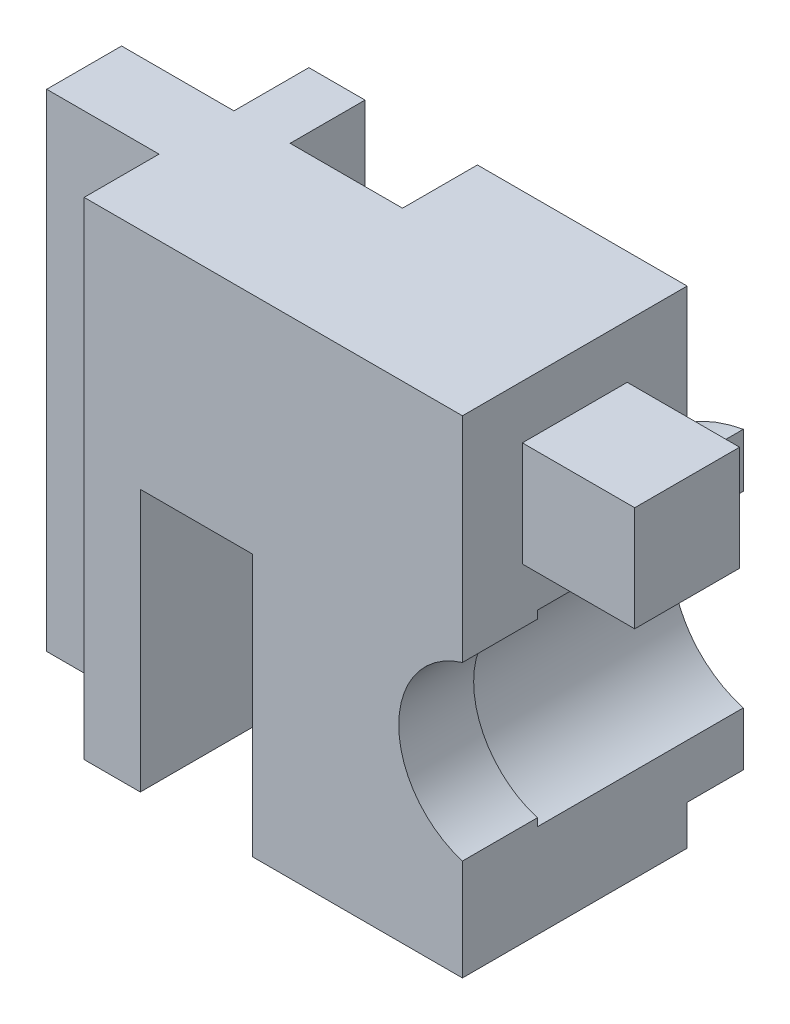
ISO-10303-21;
HEADER;
FILE_DESCRIPTION(('STEP AP214'),'2;1');
FILE_NAME('part.step','',(''),(''),'','','');
FILE_SCHEMA(('AUTOMOTIVE_DESIGN { 1 0 10303 214 1 1 1 1 }'));
ENDSEC;
DATA;
#1=APPLICATION_CONTEXT('core data for automotive mechanical design processes');
#2=APPLICATION_PROTOCOL_DEFINITION('international standard','automotive_design',2000,#1);
#3=PRODUCT_CONTEXT('',#1,'mechanical');
#4=PRODUCT('Part','Part','',(#3));
#5=PRODUCT_RELATED_PRODUCT_CATEGORY('part','',(#4));
#6=PRODUCT_DEFINITION_FORMATION('','',#4);
#7=PRODUCT_DEFINITION_CONTEXT('part definition',#1,'design');
#8=PRODUCT_DEFINITION('design','',#6,#7);
#9=PRODUCT_DEFINITION_SHAPE('','',#8);
#10=(LENGTH_UNIT() NAMED_UNIT(*) SI_UNIT(.MILLI.,.METRE.));
#11=(NAMED_UNIT(*) PLANE_ANGLE_UNIT() SI_UNIT($,.RADIAN.));
#12=(NAMED_UNIT(*) SI_UNIT($,.STERADIAN.) SOLID_ANGLE_UNIT());
#13=UNCERTAINTY_MEASURE_WITH_UNIT(LENGTH_MEASURE(1.E-05),#10,'distance_accuracy_value','');
#14=(GEOMETRIC_REPRESENTATION_CONTEXT(3) GLOBAL_UNCERTAINTY_ASSIGNED_CONTEXT((#13)) GLOBAL_UNIT_ASSIGNED_CONTEXT((#10,
#11,#12)) REPRESENTATION_CONTEXT('',''));
#15=CARTESIAN_POINT('',(0.,0.,0.));
#16=DIRECTION('',(0.,0.,1.));
#17=DIRECTION('',(1.,0.,0.));
#18=AXIS2_PLACEMENT_3D('',#15,#16,#17);
#19=CARTESIAN_POINT('',(-12.2,-5.,-7.5));
#20=DIRECTION('',(-1.,0.,0.));
#21=DIRECTION('',(0.,0.,1.));
#22=AXIS2_PLACEMENT_3D('',#19,#20,#21);
#23=PLANE('',#22);
#24=DIRECTION('',(0.,0.,1.));
#25=VECTOR('',#24,1.);
#26=CARTESIAN_POINT('',(-12.2,8.,-7.5));
#27=LINE('',#26,#25);
#28=CARTESIAN_POINT('',(-12.2,8.,0.));
#29=VERTEX_POINT('',#28);
#30=CARTESIAN_POINT('',(-12.2,8.,6.));
#31=VERTEX_POINT('',#30);
#32=EDGE_CURVE('E433',#29,#31,#27,.T.);
#33=ORIENTED_EDGE('',*,*,#32,.T.);
#34=DIRECTION('',(0.,-1.,0.));
#35=VECTOR('',#34,1.);
#36=CARTESIAN_POINT('',(-12.2,0.,6.));
#37=LINE('',#36,#35);
#38=CARTESIAN_POINT('',(-12.2,2.2956480566498,6.));
#39=VERTEX_POINT('',#38);
#40=EDGE_CURVE('E57',#31,#39,#37,.T.);
#41=ORIENTED_EDGE('',*,*,#40,.T.);
#42=DIRECTION('',(0.,0.,1.));
#43=VECTOR('',#42,1.);
#44=CARTESIAN_POINT('',(-12.2,2.2956480566498,4.));
#45=LINE('',#44,#43);
#46=CARTESIAN_POINT('',(-12.2,2.2956480566498,4.));
#47=VERTEX_POINT('',#46);
#48=EDGE_CURVE('E280',#47,#39,#45,.T.);
#49=ORIENTED_EDGE('',*,*,#48,.F.);
#50=DIRECTION('',(0.,-1.,0.));
#51=VECTOR('',#50,1.);
#52=CARTESIAN_POINT('',(-12.2,0.,4.));
#53=LINE('',#52,#51);
#54=CARTESIAN_POINT('',(-12.2,2.50399680510978,4.));
#55=VERTEX_POINT('',#54);
#56=EDGE_CURVE('E469',#55,#47,#53,.T.);
#57=ORIENTED_EDGE('',*,*,#56,.F.);
#58=DIRECTION('',(0.,0.,-1.));
#59=VECTOR('',#58,1.);
#60=CARTESIAN_POINT('',(-12.2,2.50399680510978,6.));
#61=LINE('',#60,#59);
#62=CARTESIAN_POINT('',(-12.2,2.50399680510978,-1.5));
#63=VERTEX_POINT('',#62);
#64=EDGE_CURVE('E459',#55,#63,#61,.T.);
#65=ORIENTED_EDGE('',*,*,#64,.T.);
#66=DIRECTION('',(0.,-1.,0.));
#67=VECTOR('',#66,1.);
#68=CARTESIAN_POINT('',(-12.2,0.,-1.5));
#69=LINE('',#68,#67);
#70=CARTESIAN_POINT('',(-12.2,3.93827373350304,-1.5));
#71=VERTEX_POINT('',#70);
#72=EDGE_CURVE('E460',#71,#63,#69,.T.);
#73=ORIENTED_EDGE('',*,*,#72,.F.);
#74=DIRECTION('',(0.,0.,1.));
#75=VECTOR('',#74,1.);
#76=CARTESIAN_POINT('',(-12.2,3.93827373350304,-1.5));
#77=LINE('',#76,#75);
#78=CARTESIAN_POINT('',(-12.2,3.93827373350304,0.));
#79=VERTEX_POINT('',#78);
#80=EDGE_CURVE('E447',#71,#79,#77,.T.);
#81=ORIENTED_EDGE('',*,*,#80,.T.);
#82=DIRECTION('',(0.,-1.,0.));
#83=VECTOR('',#82,1.);
#84=CARTESIAN_POINT('',(-12.2,0.,0.));
#85=LINE('',#84,#83);
#86=EDGE_CURVE('E450',#29,#79,#85,.T.);
#87=ORIENTED_EDGE('',*,*,#86,.F.);
#88=EDGE_LOOP('',(#33,#41,#49,#57,#65,#73,#81,#87));
#89=FACE_BOUND('',#88,.T.);
#90=DIRECTION('',(0.,1.,0.));
#91=VECTOR('',#90,1.);
#92=CARTESIAN_POINT('',(-12.2,3.77366945943055,1.6));
#93=LINE('',#92,#91);
#94=CARTESIAN_POINT('',(-12.2,3.77366945943055,1.6));
#95=VERTEX_POINT('',#94);
#96=CARTESIAN_POINT('',(-12.2,6.57366945943055,1.6));
#97=VERTEX_POINT('',#96);
#98=EDGE_CURVE('E257',#95,#97,#93,.T.);
#99=ORIENTED_EDGE('',*,*,#98,.F.);
#100=DIRECTION('',(0.,0.,-1.));
#101=VECTOR('',#100,1.);
#102=CARTESIAN_POINT('',(-12.2,3.77366945943055,4.4));
#103=LINE('',#102,#101);
#104=CARTESIAN_POINT('',(-12.2,3.77366945943055,4.4));
#105=VERTEX_POINT('',#104);
#106=EDGE_CURVE('E266',#105,#95,#103,.T.);
#107=ORIENTED_EDGE('',*,*,#106,.F.);
#108=DIRECTION('',(0.,-1.,0.));
#109=VECTOR('',#108,1.);
#110=CARTESIAN_POINT('',(-12.2,3.77366945943055,4.4));
#111=LINE('',#110,#109);
#112=CARTESIAN_POINT('',(-12.2,6.57366945943055,4.4));
#113=VERTEX_POINT('',#112);
#114=EDGE_CURVE('E231',#113,#105,#111,.T.);
#115=ORIENTED_EDGE('',*,*,#114,.F.);
#116=DIRECTION('',(0.,0.,1.));
#117=VECTOR('',#116,1.);
#118=CARTESIAN_POINT('',(-12.2,6.57366945943055,4.4));
#119=LINE('',#118,#117);
#120=EDGE_CURVE('E261',#97,#113,#119,.T.);
#121=ORIENTED_EDGE('',*,*,#120,.F.);
#122=EDGE_LOOP('',(#99,#107,#115,#121));
#123=FACE_BOUND('',#122,.T.);
#124=ADVANCED_FACE('F45',(#89,#123),#23,.F.);
#125=CARTESIAN_POINT('',(-11.5,0.,6.));
#126=DIRECTION('',(0.,0.,-1.));
#127=DIRECTION('',(-1.,0.,0.));
#128=AXIS2_PLACEMENT_3D('',#125,#126,#127);
#129=CYLINDRICAL_SURFACE('',#128,2.6);
#130=ORIENTED_EDGE('',*,*,#64,.F.);
#131=CARTESIAN_POINT('',(-11.5,0.,4.));
#132=DIRECTION('',(0.,0.,1.));
#133=DIRECTION('',(1.,0.,0.));
#134=AXIS2_PLACEMENT_3D('',#131,#132,#133);
#135=CIRCLE('',#134,2.6);
#136=CARTESIAN_POINT('',(-12.2,-2.50399680510978,4.));
#137=VERTEX_POINT('',#136);
#138=EDGE_CURVE('E275',#55,#137,#135,.T.);
#139=ORIENTED_EDGE('',*,*,#138,.T.);
#140=DIRECTION('',(0.,0.,-1.));
#141=VECTOR('',#140,1.);
#142=CARTESIAN_POINT('',(-12.2,-2.50399680510978,6.));
#143=LINE('',#142,#141);
#144=CARTESIAN_POINT('',(-12.2,-2.50399680510978,-1.5));
#145=VERTEX_POINT('',#144);
#146=EDGE_CURVE('E55',#145,#137,#143,.F.);
#147=ORIENTED_EDGE('',*,*,#146,.F.);
#148=CARTESIAN_POINT('',(-11.5,0.,-1.5));
#149=DIRECTION('',(0.,0.,1.));
#150=DIRECTION('',(1.,0.,0.));
#151=AXIS2_PLACEMENT_3D('',#148,#149,#150);
#152=CIRCLE('',#151,2.6);
#153=EDGE_CURVE('E49',#63,#145,#152,.T.);
#154=ORIENTED_EDGE('',*,*,#153,.F.);
#155=EDGE_LOOP('',(#130,#139,#147,#154));
#156=FACE_BOUND('',#155,.T.);
#157=ADVANCED_FACE('F47',(#156),#129,.F.);
#158=CARTESIAN_POINT('',(0.,8.,6.));
#159=DIRECTION('',(0.,1.,0.));
#160=DIRECTION('',(0.,0.,1.));
#161=AXIS2_PLACEMENT_3D('',#158,#159,#160);
#162=PLANE('',#161);
#163=ORIENTED_EDGE('',*,*,#32,.F.);
#164=DIRECTION('',(1.,0.,0.));
#165=VECTOR('',#164,1.);
#166=CARTESIAN_POINT('',(0.,8.,0.));
#167=LINE('',#166,#165);
#168=CARTESIAN_POINT('',(-17.8,8.,0.));
#169=VERTEX_POINT('',#168);
#170=EDGE_CURVE('E455',#169,#29,#167,.T.);
#171=ORIENTED_EDGE('',*,*,#170,.F.);
#172=DIRECTION('',(0.,0.,-1.));
#173=VECTOR('',#172,1.);
#174=CARTESIAN_POINT('',(-17.8,8.,2.));
#175=LINE('',#174,#173);
#176=CARTESIAN_POINT('',(-17.8,8.,2.));
#177=VERTEX_POINT('',#176);
#178=EDGE_CURVE('E414',#177,#169,#175,.T.);
#179=ORIENTED_EDGE('',*,*,#178,.F.);
#180=DIRECTION('',(1.,0.,0.));
#181=VECTOR('',#180,1.);
#182=CARTESIAN_POINT('',(-20.8,8.,2.));
#183=LINE('',#182,#181);
#184=CARTESIAN_POINT('',(-20.8,8.,2.));
#185=VERTEX_POINT('',#184);
#186=EDGE_CURVE('E437',#185,#177,#183,.T.);
#187=ORIENTED_EDGE('',*,*,#186,.F.);
#188=DIRECTION('',(0.,0.,-1.));
#189=VECTOR('',#188,1.);
#190=CARTESIAN_POINT('',(-20.8,8.,2.));
#191=LINE('',#190,#189);
#192=CARTESIAN_POINT('',(-20.8,8.,0.));
#193=VERTEX_POINT('',#192);
#194=EDGE_CURVE('E409',#185,#193,#191,.T.);
#195=ORIENTED_EDGE('',*,*,#194,.T.);
#196=CARTESIAN_POINT('',(-22.3,8.,0.));
#197=VERTEX_POINT('',#196);
#198=EDGE_CURVE('E285',#197,#193,#167,.T.);
#199=ORIENTED_EDGE('',*,*,#198,.F.);
#200=DIRECTION('',(0.,0.,-1.));
#201=VECTOR('',#200,1.);
#202=CARTESIAN_POINT('',(-22.3,8.,6.));
#203=LINE('',#202,#201);
#204=CARTESIAN_POINT('',(-22.3,8.,2.));
#205=VERTEX_POINT('',#204);
#206=EDGE_CURVE('E292',#205,#197,#203,.T.);
#207=ORIENTED_EDGE('',*,*,#206,.F.);
#208=DIRECTION('',(1.,0.,0.));
#209=VECTOR('',#208,1.);
#210=CARTESIAN_POINT('',(0.,8.,1.99999999999999));
#211=LINE('',#210,#209);
#212=CARTESIAN_POINT('',(-25.3,8.,2.));
#213=VERTEX_POINT('',#212);
#214=EDGE_CURVE('E325',#213,#205,#211,.T.);
#215=ORIENTED_EDGE('',*,*,#214,.F.);
#216=DIRECTION('',(0.,0.,-1.));
#217=VECTOR('',#216,1.);
#218=CARTESIAN_POINT('',(-25.3,8.,6.));
#219=LINE('',#218,#217);
#220=CARTESIAN_POINT('',(-25.3,8.,4.));
#221=VERTEX_POINT('',#220);
#222=EDGE_CURVE('E321',#221,#213,#219,.T.);
#223=ORIENTED_EDGE('',*,*,#222,.F.);
#224=DIRECTION('',(-1.,0.,0.));
#225=VECTOR('',#224,1.);
#226=CARTESIAN_POINT('',(0.,8.,3.99999999999999));
#227=LINE('',#226,#225);
#228=CARTESIAN_POINT('',(-22.3,8.,4.));
#229=VERTEX_POINT('',#228);
#230=EDGE_CURVE('E317',#229,#221,#227,.T.);
#231=ORIENTED_EDGE('',*,*,#230,.F.);
#232=CARTESIAN_POINT('',(-22.3,8.,6.));
#233=VERTEX_POINT('',#232);
#234=EDGE_CURVE('E286',#233,#229,#203,.T.);
#235=ORIENTED_EDGE('',*,*,#234,.F.);
#236=DIRECTION('',(1.,0.,0.));
#237=VECTOR('',#236,1.);
#238=CARTESIAN_POINT('',(0.,8.,6.));
#239=LINE('',#238,#237);
#240=EDGE_CURVE('E413',#233,#31,#239,.T.);
#241=ORIENTED_EDGE('',*,*,#240,.T.);
#242=EDGE_LOOP('',(#163,#171,#179,#187,#195,#199,#207,#215,#223,#231,#235,#241));
#243=FACE_BOUND('',#242,.T.);
#244=ADVANCED_FACE('F566',(#243),#162,.T.);
#245=CARTESIAN_POINT('',(0.,-5.,6.));
#246=DIRECTION('',(0.,1.,0.));
#247=DIRECTION('',(-1.,0.,0.));
#248=AXIS2_PLACEMENT_3D('',#245,#246,#247);
#249=PLANE('',#248);
#250=DIRECTION('',(1.,0.,0.));
#251=VECTOR('',#250,1.);
#252=CARTESIAN_POINT('',(0.,-5.,0.));
#253=LINE('',#252,#251);
#254=CARTESIAN_POINT('',(-16.3,-5.,0.));
#255=VERTEX_POINT('',#254);
#256=CARTESIAN_POINT('',(-12.2,-5.,0.));
#257=VERTEX_POINT('',#256);
#258=EDGE_CURVE('E478',#255,#257,#253,.T.);
#259=ORIENTED_EDGE('',*,*,#258,.T.);
#260=DIRECTION('',(0.,0.,1.));
#261=VECTOR('',#260,1.);
#262=CARTESIAN_POINT('',(-12.2,-5.,-7.5));
#263=LINE('',#262,#261);
#264=CARTESIAN_POINT('',(-12.2,-5.,6.));
#265=VERTEX_POINT('',#264);
#266=EDGE_CURVE('E306',#257,#265,#263,.T.);
#267=ORIENTED_EDGE('',*,*,#266,.T.);
#268=DIRECTION('',(1.,0.,0.));
#269=VECTOR('',#268,1.);
#270=CARTESIAN_POINT('',(0.,-5.,6.));
#271=LINE('',#270,#269);
#272=CARTESIAN_POINT('',(-17.8,-4.99999999999999,6.));
#273=VERTEX_POINT('',#272);
#274=EDGE_CURVE('E360',#273,#265,#271,.T.);
#275=ORIENTED_EDGE('',*,*,#274,.F.);
#276=DIRECTION('',(0.,0.,1.));
#277=VECTOR('',#276,1.);
#278=CARTESIAN_POINT('',(-17.8,-4.99999999999999,2.));
#279=LINE('',#278,#277);
#280=CARTESIAN_POINT('',(-17.8,-4.99999999999999,2.));
#281=VERTEX_POINT('',#280);
#282=EDGE_CURVE('E355',#281,#273,#279,.T.);
#283=ORIENTED_EDGE('',*,*,#282,.F.);
#284=DIRECTION('',(-1.,0.,0.));
#285=VECTOR('',#284,1.);
#286=CARTESIAN_POINT('',(-17.8,-4.99999999999999,2.));
#287=LINE('',#286,#285);
#288=CARTESIAN_POINT('',(-16.3,-5.,2.));
#289=VERTEX_POINT('',#288);
#290=EDGE_CURVE('E351',#289,#281,#287,.T.);
#291=ORIENTED_EDGE('',*,*,#290,.F.);
#292=DIRECTION('',(0.,0.,1.));
#293=VECTOR('',#292,1.);
#294=CARTESIAN_POINT('',(-16.3,-5.,0.));
#295=LINE('',#294,#293);
#296=EDGE_CURVE('E347',#255,#289,#295,.T.);
#297=ORIENTED_EDGE('',*,*,#296,.F.);
#298=EDGE_LOOP('',(#259,#267,#275,#283,#291,#297));
#299=FACE_BOUND('',#298,.T.);
#300=ADVANCED_FACE('F521',(#299),#249,.F.);
#301=CARTESIAN_POINT('',(0.,0.,6.));
#302=DIRECTION('',(0.,0.,1.));
#303=DIRECTION('',(1.,0.,0.));
#304=AXIS2_PLACEMENT_3D('',#301,#302,#303);
#305=PLANE('',#304);
#306=ORIENTED_EDGE('',*,*,#40,.F.);
#307=ORIENTED_EDGE('',*,*,#240,.F.);
#308=DIRECTION('',(0.,-1.,0.));
#309=VECTOR('',#308,1.);
#310=CARTESIAN_POINT('',(-22.3,8.,6.));
#311=LINE('',#310,#309);
#312=CARTESIAN_POINT('',(-22.3,-5.,6.));
#313=VERTEX_POINT('',#312);
#314=EDGE_CURVE('E301',#233,#313,#311,.T.);
#315=ORIENTED_EDGE('',*,*,#314,.T.);
#316=CARTESIAN_POINT('',(-20.8,-4.99999999999999,6.));
#317=VERTEX_POINT('',#316);
#318=EDGE_CURVE('E305',#313,#317,#271,.T.);
#319=ORIENTED_EDGE('',*,*,#318,.T.);
#320=DIRECTION('',(0.,-1.,0.));
#321=VECTOR('',#320,1.);
#322=CARTESIAN_POINT('',(-20.8,2.,6.));
#323=LINE('',#322,#321);
#324=CARTESIAN_POINT('',(-20.8,2.,6.));
#325=VERTEX_POINT('',#324);
#326=EDGE_CURVE('E361',#325,#317,#323,.T.);
#327=ORIENTED_EDGE('',*,*,#326,.F.);
#328=DIRECTION('',(-1.,0.,0.));
#329=VECTOR('',#328,1.);
#330=CARTESIAN_POINT('',(-20.8,2.,6.));
#331=LINE('',#330,#329);
#332=CARTESIAN_POINT('',(-17.8,2.,6.));
#333=VERTEX_POINT('',#332);
#334=EDGE_CURVE('E386',#333,#325,#331,.T.);
#335=ORIENTED_EDGE('',*,*,#334,.F.);
#336=DIRECTION('',(0.,-1.,0.));
#337=VECTOR('',#336,1.);
#338=CARTESIAN_POINT('',(-17.8,2.,6.));
#339=LINE('',#338,#337);
#340=EDGE_CURVE('E356',#333,#273,#339,.T.);
#341=ORIENTED_EDGE('',*,*,#340,.T.);
#342=ORIENTED_EDGE('',*,*,#274,.T.);
#343=CARTESIAN_POINT('',(-12.2,-2.2956480566498,6.));
#344=VERTEX_POINT('',#343);
#345=EDGE_CURVE('E12',#344,#265,#37,.T.);
#346=ORIENTED_EDGE('',*,*,#345,.F.);
#347=CARTESIAN_POINT('',(-11.5,0.,6.));
#348=DIRECTION('',(0.,0.,1.));
#349=DIRECTION('',(1.,0.,0.));
#350=AXIS2_PLACEMENT_3D('',#347,#348,#349);
#351=CIRCLE('',#350,2.4);
#352=EDGE_CURVE('E281',#39,#344,#351,.T.);
#353=ORIENTED_EDGE('',*,*,#352,.F.);
#354=EDGE_LOOP('',(#306,#307,#315,#319,#327,#335,#341,#342,#346,#353));
#355=FACE_BOUND('',#354,.T.);
#356=ADVANCED_FACE('F559',(#355),#305,.T.);
#357=CARTESIAN_POINT('',(0.,0.,0.));
#358=DIRECTION('',(0.,0.,1.));
#359=DIRECTION('',(1.,0.,0.));
#360=AXIS2_PLACEMENT_3D('',#357,#358,#359);
#361=PLANE('',#360);
#362=ORIENTED_EDGE('',*,*,#170,.T.);
#363=ORIENTED_EDGE('',*,*,#86,.T.);
#364=CARTESIAN_POINT('',(-11.5,0.,0.));
#365=DIRECTION('',(0.,0.,1.));
#366=DIRECTION('',(1.,0.,0.));
#367=AXIS2_PLACEMENT_3D('',#364,#365,#366);
#368=CIRCLE('',#367,4.);
#369=CARTESIAN_POINT('',(-12.2,-3.93827373350304,0.));
#370=VERTEX_POINT('',#369);
#371=EDGE_CURVE('E454',#79,#370,#368,.T.);
#372=ORIENTED_EDGE('',*,*,#371,.T.);
#373=EDGE_CURVE('E456',#370,#257,#85,.T.);
#374=ORIENTED_EDGE('',*,*,#373,.T.);
#375=ORIENTED_EDGE('',*,*,#258,.F.);
#376=DIRECTION('',(0.,-1.,0.));
#377=VECTOR('',#376,1.);
#378=CARTESIAN_POINT('',(-16.3,2.,0.));
#379=LINE('',#378,#377);
#380=CARTESIAN_POINT('',(-16.3,2.,0.));
#381=VERTEX_POINT('',#380);
#382=EDGE_CURVE('E343',#381,#255,#379,.T.);
#383=ORIENTED_EDGE('',*,*,#382,.F.);
#384=DIRECTION('',(1.,0.,0.));
#385=VECTOR('',#384,1.);
#386=CARTESIAN_POINT('',(-22.3,2.,0.));
#387=LINE('',#386,#385);
#388=CARTESIAN_POINT('',(-17.8,2.,0.));
#389=VERTEX_POINT('',#388);
#390=EDGE_CURVE('E403',#389,#381,#387,.T.);
#391=ORIENTED_EDGE('',*,*,#390,.F.);
#392=DIRECTION('',(0.,-1.,0.));
#393=VECTOR('',#392,1.);
#394=CARTESIAN_POINT('',(-17.8,2.,0.));
#395=LINE('',#394,#393);
#396=EDGE_CURVE('E418',#169,#389,#395,.T.);
#397=ORIENTED_EDGE('',*,*,#396,.F.);
#398=EDGE_LOOP('',(#362,#363,#372,#374,#375,#383,#391,#397));
#399=FACE_BOUND('',#398,.T.);
#400=ADVANCED_FACE('F515',(#399),#361,.F.);
#401=CARTESIAN_POINT('',(-11.5,0.,-1.5));
#402=DIRECTION('',(0.,0.,1.));
#403=DIRECTION('',(1.,0.,0.));
#404=AXIS2_PLACEMENT_3D('',#401,#402,#403);
#405=CYLINDRICAL_SURFACE('',#404,4.);
#406=DIRECTION('',(0.,0.,1.));
#407=VECTOR('',#406,1.);
#408=CARTESIAN_POINT('',(-12.2,-3.93827373350304,-1.5));
#409=LINE('',#408,#407);
#410=CARTESIAN_POINT('',(-12.2,-3.93827373350304,-1.5));
#411=VERTEX_POINT('',#410);
#412=EDGE_CURVE('E444',#370,#411,#409,.F.);
#413=ORIENTED_EDGE('',*,*,#412,.F.);
#414=ORIENTED_EDGE('',*,*,#371,.F.);
#415=ORIENTED_EDGE('',*,*,#80,.F.);
#416=CARTESIAN_POINT('',(-11.5,0.,-1.5));
#417=DIRECTION('',(0.,0.,1.));
#418=DIRECTION('',(1.,0.,0.));
#419=AXIS2_PLACEMENT_3D('',#416,#417,#418);
#420=CIRCLE('',#419,4.);
#421=EDGE_CURVE('E464',#71,#411,#420,.T.);
#422=ORIENTED_EDGE('',*,*,#421,.T.);
#423=EDGE_LOOP('',(#413,#414,#415,#422));
#424=FACE_BOUND('',#423,.T.);
#425=ADVANCED_FACE('F683',(#424),#405,.T.);
#426=CARTESIAN_POINT('',(-11.5,0.,-1.5));
#427=DIRECTION('',(0.,0.,1.));
#428=DIRECTION('',(1.,0.,0.));
#429=AXIS2_PLACEMENT_3D('',#426,#427,#428);
#430=PLANE('',#429);
#431=ORIENTED_EDGE('',*,*,#421,.F.);
#432=ORIENTED_EDGE('',*,*,#72,.T.);
#433=ORIENTED_EDGE('',*,*,#153,.T.);
#434=EDGE_CURVE('E465',#145,#411,#69,.T.);
#435=ORIENTED_EDGE('',*,*,#434,.T.);
#436=EDGE_LOOP('',(#431,#432,#433,#435));
#437=FACE_BOUND('',#436,.T.);
#438=ADVANCED_FACE('F544',(#437),#430,.F.);
#439=CARTESIAN_POINT('',(-11.5,0.,4.));
#440=DIRECTION('',(0.,0.,1.));
#441=DIRECTION('',(1.,0.,0.));
#442=AXIS2_PLACEMENT_3D('',#439,#440,#441);
#443=PLANE('',#442);
#444=ORIENTED_EDGE('',*,*,#138,.F.);
#445=ORIENTED_EDGE('',*,*,#56,.T.);
#446=CARTESIAN_POINT('',(-11.5,0.,4.));
#447=DIRECTION('',(0.,0.,1.));
#448=DIRECTION('',(1.,0.,0.));
#449=AXIS2_PLACEMENT_3D('',#446,#447,#448);
#450=CIRCLE('',#449,2.4);
#451=CARTESIAN_POINT('',(-12.2,-2.2956480566498,4.));
#452=VERTEX_POINT('',#451);
#453=EDGE_CURVE('E473',#47,#452,#450,.T.);
#454=ORIENTED_EDGE('',*,*,#453,.T.);
#455=EDGE_CURVE('E474',#452,#137,#53,.T.);
#456=ORIENTED_EDGE('',*,*,#455,.T.);
#457=EDGE_LOOP('',(#444,#445,#454,#456));
#458=FACE_BOUND('',#457,.T.);
#459=ADVANCED_FACE('F551',(#458),#443,.F.);
#460=CARTESIAN_POINT('',(-11.5,0.,4.));
#461=DIRECTION('',(0.,0.,1.));
#462=DIRECTION('',(1.,0.,0.));
#463=AXIS2_PLACEMENT_3D('',#460,#461,#462);
#464=CYLINDRICAL_SURFACE('',#463,2.4);
#465=ORIENTED_EDGE('',*,*,#352,.T.);
#466=DIRECTION('',(0.,0.,1.));
#467=VECTOR('',#466,1.);
#468=CARTESIAN_POINT('',(-12.2,-2.2956480566498,4.));
#469=LINE('',#468,#467);
#470=EDGE_CURVE('E276',#344,#452,#469,.F.);
#471=ORIENTED_EDGE('',*,*,#470,.T.);
#472=ORIENTED_EDGE('',*,*,#453,.F.);
#473=ORIENTED_EDGE('',*,*,#48,.T.);
#474=EDGE_LOOP('',(#465,#471,#472,#473));
#475=FACE_BOUND('',#474,.T.);
#476=ADVANCED_FACE('F554',(#475),#464,.F.);
#477=ORIENTED_EDGE('',*,*,#198,.T.);
#478=DIRECTION('',(0.,1.,0.));
#479=VECTOR('',#478,1.);
#480=CARTESIAN_POINT('',(-20.8,2.,0.));
#481=LINE('',#480,#479);
#482=CARTESIAN_POINT('',(-20.8,2.,0.));
#483=VERTEX_POINT('',#482);
#484=EDGE_CURVE('E402',#483,#193,#481,.T.);
#485=ORIENTED_EDGE('',*,*,#484,.F.);
#486=CARTESIAN_POINT('',(-22.3,2.,0.));
#487=VERTEX_POINT('',#486);
#488=EDGE_CURVE('E382',#487,#483,#387,.T.);
#489=ORIENTED_EDGE('',*,*,#488,.F.);
#490=DIRECTION('',(0.,-1.,0.));
#491=VECTOR('',#490,1.);
#492=CARTESIAN_POINT('',(-22.3,8.,0.));
#493=LINE('',#492,#491);
#494=EDGE_CURVE('E290',#197,#487,#493,.T.);
#495=ORIENTED_EDGE('',*,*,#494,.F.);
#496=EDGE_LOOP('',(#477,#485,#489,#495));
#497=FACE_BOUND('',#496,.T.);
#498=ADVANCED_FACE('F672',(#497),#361,.F.);
#499=CARTESIAN_POINT('',(0.,2.,0.));
#500=DIRECTION('',(0.,1.,0.));
#501=DIRECTION('',(0.,0.,1.));
#502=AXIS2_PLACEMENT_3D('',#499,#500,#501);
#503=PLANE('',#502);
#504=ORIENTED_EDGE('',*,*,#488,.T.);
#505=DIRECTION('',(0.,0.,-1.));
#506=VECTOR('',#505,1.);
#507=CARTESIAN_POINT('',(-20.8,2.,2.));
#508=LINE('',#507,#506);
#509=CARTESIAN_POINT('',(-20.8,2.,2.));
#510=VERTEX_POINT('',#509);
#511=EDGE_CURVE('E422',#510,#483,#508,.T.);
#512=ORIENTED_EDGE('',*,*,#511,.F.);
#513=DIRECTION('',(-1.,0.,0.));
#514=VECTOR('',#513,1.);
#515=CARTESIAN_POINT('',(-22.3,2.,2.));
#516=LINE('',#515,#514);
#517=CARTESIAN_POINT('',(-22.3,2.,2.));
#518=VERTEX_POINT('',#517);
#519=EDGE_CURVE('E378',#510,#518,#516,.T.);
#520=ORIENTED_EDGE('',*,*,#519,.T.);
#521=DIRECTION('',(0.,0.,-1.));
#522=VECTOR('',#521,1.);
#523=CARTESIAN_POINT('',(-22.3,2.,0.));
#524=LINE('',#523,#522);
#525=EDGE_CURVE('E381',#518,#487,#524,.T.);
#526=ORIENTED_EDGE('',*,*,#525,.T.);
#527=EDGE_LOOP('',(#504,#512,#520,#526));
#528=FACE_BOUND('',#527,.T.);
#529=ADVANCED_FACE('F637',(#528),#503,.F.);
#530=DIRECTION('',(-1.,0.,0.));
#531=VECTOR('',#530,1.);
#532=CARTESIAN_POINT('',(-20.8,2.,2.));
#533=LINE('',#532,#531);
#534=CARTESIAN_POINT('',(-17.8,2.,2.));
#535=VERTEX_POINT('',#534);
#536=EDGE_CURVE('E429',#535,#510,#533,.T.);
#537=ORIENTED_EDGE('',*,*,#536,.F.);
#538=DIRECTION('',(0.,0.,1.));
#539=VECTOR('',#538,1.);
#540=CARTESIAN_POINT('',(-17.8,2.,2.));
#541=LINE('',#540,#539);
#542=EDGE_CURVE('E390',#535,#333,#541,.T.);
#543=ORIENTED_EDGE('',*,*,#542,.T.);
#544=ORIENTED_EDGE('',*,*,#334,.T.);
#545=DIRECTION('',(0.,0.,-1.));
#546=VECTOR('',#545,1.);
#547=CARTESIAN_POINT('',(-20.8,2.,2.));
#548=LINE('',#547,#546);
#549=EDGE_CURVE('E296',#325,#510,#548,.T.);
#550=ORIENTED_EDGE('',*,*,#549,.T.);
#551=EDGE_LOOP('',(#537,#543,#544,#550));
#552=FACE_BOUND('',#551,.T.);
#553=ADVANCED_FACE('F589',(#552),#503,.F.);
#554=DIRECTION('',(-1.,0.,0.));
#555=VECTOR('',#554,1.);
#556=CARTESIAN_POINT('',(0.,-5.,1.99999999999999));
#557=LINE('',#556,#555);
#558=CARTESIAN_POINT('',(-20.8,-4.99999999999999,2.));
#559=VERTEX_POINT('',#558);
#560=CARTESIAN_POINT('',(-25.3,-4.99999999999999,2.));
#561=VERTEX_POINT('',#560);
#562=EDGE_CURVE('E326',#559,#561,#557,.T.);
#563=ORIENTED_EDGE('',*,*,#562,.F.);
#564=DIRECTION('',(0.,0.,-1.));
#565=VECTOR('',#564,1.);
#566=CARTESIAN_POINT('',(-20.8,-4.99999999999999,2.));
#567=LINE('',#566,#565);
#568=EDGE_CURVE('E337',#317,#559,#567,.T.);
#569=ORIENTED_EDGE('',*,*,#568,.F.);
#570=ORIENTED_EDGE('',*,*,#318,.F.);
#571=DIRECTION('',(0.,0.,-1.));
#572=VECTOR('',#571,1.);
#573=CARTESIAN_POINT('',(-22.3,-5.,6.));
#574=LINE('',#573,#572);
#575=CARTESIAN_POINT('',(-22.3,-4.99999999999999,4.));
#576=VERTEX_POINT('',#575);
#577=EDGE_CURVE('E291',#313,#576,#574,.T.);
#578=ORIENTED_EDGE('',*,*,#577,.T.);
#579=DIRECTION('',(1.,0.,0.));
#580=VECTOR('',#579,1.);
#581=CARTESIAN_POINT('',(0.,-5.,3.99999999999999));
#582=LINE('',#581,#580);
#583=CARTESIAN_POINT('',(-25.3,-4.99999999999999,4.));
#584=VERTEX_POINT('',#583);
#585=EDGE_CURVE('E318',#584,#576,#582,.T.);
#586=ORIENTED_EDGE('',*,*,#585,.F.);
#587=DIRECTION('',(0.,0.,1.));
#588=VECTOR('',#587,1.);
#589=CARTESIAN_POINT('',(-25.3,-4.99999999999999,6.));
#590=LINE('',#589,#588);
#591=EDGE_CURVE('E307',#561,#584,#590,.T.);
#592=ORIENTED_EDGE('',*,*,#591,.F.);
#593=EDGE_LOOP('',(#563,#569,#570,#578,#586,#592));
#594=FACE_BOUND('',#593,.T.);
#595=ADVANCED_FACE('F579',(#594),#249,.F.);
#596=CARTESIAN_POINT('',(-22.3,8.,6.));
#597=DIRECTION('',(1.,0.,0.));
#598=DIRECTION('',(0.,0.,-1.));
#599=AXIS2_PLACEMENT_3D('',#596,#597,#598);
#600=PLANE('',#599);
#601=DIRECTION('',(0.,1.,0.));
#602=VECTOR('',#601,1.);
#603=CARTESIAN_POINT('',(-22.3,-8.60555127546399,4.));
#604=LINE('',#603,#602);
#605=EDGE_CURVE('E314',#576,#229,#604,.T.);
#606=ORIENTED_EDGE('',*,*,#605,.F.);
#607=ORIENTED_EDGE('',*,*,#577,.F.);
#608=ORIENTED_EDGE('',*,*,#314,.F.);
#609=ORIENTED_EDGE('',*,*,#234,.T.);
#610=EDGE_LOOP('',(#606,#607,#608,#609));
#611=FACE_BOUND('',#610,.T.);
#612=ADVANCED_FACE('F577',(#611),#600,.F.);
#613=ORIENTED_EDGE('',*,*,#494,.T.);
#614=ORIENTED_EDGE('',*,*,#525,.F.);
#615=DIRECTION('',(0.,1.,0.));
#616=VECTOR('',#615,1.);
#617=CARTESIAN_POINT('',(-22.3,-8.60555127546399,2.));
#618=LINE('',#617,#616);
#619=EDGE_CURVE('E300',#518,#205,#618,.T.);
#620=ORIENTED_EDGE('',*,*,#619,.T.);
#621=ORIENTED_EDGE('',*,*,#206,.T.);
#622=EDGE_LOOP('',(#613,#614,#620,#621));
#623=FACE_BOUND('',#622,.T.);
#624=ADVANCED_FACE('F654',(#623),#600,.F.);
#625=CARTESIAN_POINT('',(-25.3,-8.60555127546399,6.));
#626=DIRECTION('',(1.,0.,0.));
#627=DIRECTION('',(0.,0.,-1.));
#628=AXIS2_PLACEMENT_3D('',#625,#626,#627);
#629=PLANE('',#628);
#630=DIRECTION('',(0.,1.,0.));
#631=VECTOR('',#630,1.);
#632=CARTESIAN_POINT('',(-25.3,-8.60555127546399,2.));
#633=LINE('',#632,#631);
#634=EDGE_CURVE('E322',#561,#213,#633,.T.);
#635=ORIENTED_EDGE('',*,*,#634,.F.);
#636=ORIENTED_EDGE('',*,*,#591,.T.);
#637=DIRECTION('',(0.,1.,0.));
#638=VECTOR('',#637,1.);
#639=CARTESIAN_POINT('',(-25.3,-8.60555127546399,4.));
#640=LINE('',#639,#638);
#641=EDGE_CURVE('E311',#584,#221,#640,.T.);
#642=ORIENTED_EDGE('',*,*,#641,.T.);
#643=ORIENTED_EDGE('',*,*,#222,.T.);
#644=EDGE_LOOP('',(#635,#636,#642,#643));
#645=FACE_BOUND('',#644,.T.);
#646=ADVANCED_FACE('F649',(#645),#629,.F.);
#647=CARTESIAN_POINT('',(0.,-8.60555127546399,3.99999999999999));
#648=DIRECTION('',(0.,0.,-1.));
#649=DIRECTION('',(-1.,0.,0.));
#650=AXIS2_PLACEMENT_3D('',#647,#648,#649);
#651=PLANE('',#650);
#652=ORIENTED_EDGE('',*,*,#641,.F.);
#653=ORIENTED_EDGE('',*,*,#585,.T.);
#654=ORIENTED_EDGE('',*,*,#605,.T.);
#655=ORIENTED_EDGE('',*,*,#230,.T.);
#656=EDGE_LOOP('',(#652,#653,#654,#655));
#657=FACE_BOUND('',#656,.T.);
#658=ADVANCED_FACE('F643',(#657),#651,.F.);
#659=CARTESIAN_POINT('',(0.,-8.60555127546399,1.99999999999999));
#660=DIRECTION('',(0.,0.,1.));
#661=DIRECTION('',(1.,0.,0.));
#662=AXIS2_PLACEMENT_3D('',#659,#660,#661);
#663=PLANE('',#662);
#664=ORIENTED_EDGE('',*,*,#619,.F.);
#665=ORIENTED_EDGE('',*,*,#519,.F.);
#666=DIRECTION('',(0.,-1.,0.));
#667=VECTOR('',#666,1.);
#668=CARTESIAN_POINT('',(-20.8,2.,2.));
#669=LINE('',#668,#667);
#670=EDGE_CURVE('E333',#510,#559,#669,.T.);
#671=ORIENTED_EDGE('',*,*,#670,.T.);
#672=ORIENTED_EDGE('',*,*,#562,.T.);
#673=ORIENTED_EDGE('',*,*,#634,.T.);
#674=ORIENTED_EDGE('',*,*,#214,.T.);
#675=EDGE_LOOP('',(#664,#665,#671,#672,#673,#674));
#676=FACE_BOUND('',#675,.T.);
#677=ADVANCED_FACE('F639',(#676),#663,.F.);
#678=CARTESIAN_POINT('',(-20.8,2.,2.));
#679=DIRECTION('',(-1.,0.,0.));
#680=DIRECTION('',(0.,-1.,0.));
#681=AXIS2_PLACEMENT_3D('',#678,#679,#680);
#682=PLANE('',#681);
#683=ORIENTED_EDGE('',*,*,#568,.T.);
#684=ORIENTED_EDGE('',*,*,#670,.F.);
#685=ORIENTED_EDGE('',*,*,#549,.F.);
#686=ORIENTED_EDGE('',*,*,#326,.T.);
#687=EDGE_LOOP('',(#683,#684,#685,#686));
#688=FACE_BOUND('',#687,.T.);
#689=ADVANCED_FACE('F584',(#688),#682,.F.);
#690=CARTESIAN_POINT('',(-17.8,2.,2.));
#691=DIRECTION('',(1.,0.,0.));
#692=DIRECTION('',(0.,1.,0.));
#693=AXIS2_PLACEMENT_3D('',#690,#691,#692);
#694=PLANE('',#693);
#695=ORIENTED_EDGE('',*,*,#282,.T.);
#696=ORIENTED_EDGE('',*,*,#340,.F.);
#697=ORIENTED_EDGE('',*,*,#542,.F.);
#698=DIRECTION('',(0.,-1.,0.));
#699=VECTOR('',#698,1.);
#700=CARTESIAN_POINT('',(-17.8,2.,2.));
#701=LINE('',#700,#699);
#702=EDGE_CURVE('E352',#535,#281,#701,.T.);
#703=ORIENTED_EDGE('',*,*,#702,.T.);
#704=EDGE_LOOP('',(#695,#696,#697,#703));
#705=FACE_BOUND('',#704,.T.);
#706=ADVANCED_FACE('F593',(#705),#694,.F.);
#707=CARTESIAN_POINT('',(-17.8,2.,2.));
#708=DIRECTION('',(0.,0.,1.));
#709=DIRECTION('',(1.,0.,0.));
#710=AXIS2_PLACEMENT_3D('',#707,#708,#709);
#711=PLANE('',#710);
#712=ORIENTED_EDGE('',*,*,#290,.T.);
#713=ORIENTED_EDGE('',*,*,#702,.F.);
#714=DIRECTION('',(-1.,0.,0.));
#715=VECTOR('',#714,1.);
#716=CARTESIAN_POINT('',(-17.8,2.,2.));
#717=LINE('',#716,#715);
#718=CARTESIAN_POINT('',(-16.3,2.,2.));
#719=VERTEX_POINT('',#718);
#720=EDGE_CURVE('E346',#719,#535,#717,.T.);
#721=ORIENTED_EDGE('',*,*,#720,.F.);
#722=DIRECTION('',(0.,-1.,0.));
#723=VECTOR('',#722,1.);
#724=CARTESIAN_POINT('',(-16.3,2.,2.));
#725=LINE('',#724,#723);
#726=EDGE_CURVE('E348',#719,#289,#725,.T.);
#727=ORIENTED_EDGE('',*,*,#726,.T.);
#728=EDGE_LOOP('',(#712,#713,#721,#727));
#729=FACE_BOUND('',#728,.T.);
#730=ADVANCED_FACE('F597',(#729),#711,.F.);
#731=CARTESIAN_POINT('',(-16.3,2.,0.));
#732=DIRECTION('',(1.,0.,0.));
#733=DIRECTION('',(0.,0.,-1.));
#734=AXIS2_PLACEMENT_3D('',#731,#732,#733);
#735=PLANE('',#734);
#736=ORIENTED_EDGE('',*,*,#296,.T.);
#737=ORIENTED_EDGE('',*,*,#726,.F.);
#738=DIRECTION('',(0.,0.,1.));
#739=VECTOR('',#738,1.);
#740=CARTESIAN_POINT('',(-16.3,2.,0.));
#741=LINE('',#740,#739);
#742=EDGE_CURVE('E398',#381,#719,#741,.T.);
#743=ORIENTED_EDGE('',*,*,#742,.F.);
#744=ORIENTED_EDGE('',*,*,#382,.T.);
#745=EDGE_LOOP('',(#736,#737,#743,#744));
#746=FACE_BOUND('',#745,.T.);
#747=ADVANCED_FACE('F527',(#746),#735,.F.);
#748=ORIENTED_EDGE('',*,*,#720,.T.);
#749=DIRECTION('',(0.,0.,-1.));
#750=VECTOR('',#749,1.);
#751=CARTESIAN_POINT('',(-17.8,2.,2.));
#752=LINE('',#751,#750);
#753=EDGE_CURVE('E397',#535,#389,#752,.T.);
#754=ORIENTED_EDGE('',*,*,#753,.T.);
#755=ORIENTED_EDGE('',*,*,#390,.T.);
#756=ORIENTED_EDGE('',*,*,#742,.T.);
#757=EDGE_LOOP('',(#748,#754,#755,#756));
#758=FACE_BOUND('',#757,.T.);
#759=ADVANCED_FACE('F594',(#758),#503,.F.);
#760=CARTESIAN_POINT('',(-20.8,2.,2.));
#761=DIRECTION('',(-1.,0.,0.));
#762=DIRECTION('',(0.,0.,1.));
#763=AXIS2_PLACEMENT_3D('',#760,#761,#762);
#764=PLANE('',#763);
#765=ORIENTED_EDGE('',*,*,#484,.T.);
#766=ORIENTED_EDGE('',*,*,#194,.F.);
#767=DIRECTION('',(0.,1.,0.));
#768=VECTOR('',#767,1.);
#769=CARTESIAN_POINT('',(-20.8,2.,2.));
#770=LINE('',#769,#768);
#771=EDGE_CURVE('E417',#510,#185,#770,.T.);
#772=ORIENTED_EDGE('',*,*,#771,.F.);
#773=ORIENTED_EDGE('',*,*,#511,.T.);
#774=EDGE_LOOP('',(#765,#766,#772,#773));
#775=FACE_BOUND('',#774,.T.);
#776=ADVANCED_FACE('F628',(#775),#764,.F.);
#777=CARTESIAN_POINT('',(-17.8,2.,2.));
#778=DIRECTION('',(1.,0.,0.));
#779=DIRECTION('',(0.,0.,-1.));
#780=AXIS2_PLACEMENT_3D('',#777,#778,#779);
#781=PLANE('',#780);
#782=ORIENTED_EDGE('',*,*,#396,.T.);
#783=ORIENTED_EDGE('',*,*,#753,.F.);
#784=DIRECTION('',(0.,-1.,0.));
#785=VECTOR('',#784,1.);
#786=CARTESIAN_POINT('',(-17.8,2.,2.));
#787=LINE('',#786,#785);
#788=EDGE_CURVE('E434',#177,#535,#787,.T.);
#789=ORIENTED_EDGE('',*,*,#788,.F.);
#790=ORIENTED_EDGE('',*,*,#178,.T.);
#791=EDGE_LOOP('',(#782,#783,#789,#790));
#792=FACE_BOUND('',#791,.T.);
#793=ADVANCED_FACE('F623',(#792),#781,.F.);
#794=CARTESIAN_POINT('',(0.,0.,2.));
#795=DIRECTION('',(0.,0.,-1.));
#796=DIRECTION('',(-1.,0.,0.));
#797=AXIS2_PLACEMENT_3D('',#794,#795,#796);
#798=PLANE('',#797);
#799=ORIENTED_EDGE('',*,*,#771,.T.);
#800=ORIENTED_EDGE('',*,*,#186,.T.);
#801=ORIENTED_EDGE('',*,*,#788,.T.);
#802=ORIENTED_EDGE('',*,*,#536,.T.);
#803=EDGE_LOOP('',(#799,#800,#801,#802));
#804=FACE_BOUND('',#803,.T.);
#805=ADVANCED_FACE('F615',(#804),#798,.T.);
#806=ORIENTED_EDGE('',*,*,#412,.T.);
#807=ORIENTED_EDGE('',*,*,#434,.F.);
#808=ORIENTED_EDGE('',*,*,#146,.T.);
#809=ORIENTED_EDGE('',*,*,#455,.F.);
#810=ORIENTED_EDGE('',*,*,#470,.F.);
#811=ORIENTED_EDGE('',*,*,#345,.T.);
#812=ORIENTED_EDGE('',*,*,#266,.F.);
#813=ORIENTED_EDGE('',*,*,#373,.F.);
#814=EDGE_LOOP('',(#806,#807,#808,#809,#810,#811,#812,#813));
#815=FACE_BOUND('',#814,.T.);
#816=ADVANCED_FACE('F549',(#815),#23,.F.);
#817=CARTESIAN_POINT('',(-9.2,3.77366945943055,1.6));
#818=DIRECTION('',(0.,0.,1.));
#819=DIRECTION('',(1.,0.,0.));
#820=AXIS2_PLACEMENT_3D('',#817,#818,#819);
#821=PLANE('',#820);
#822=DIRECTION('',(-1.,0.,0.));
#823=VECTOR('',#822,1.);
#824=CARTESIAN_POINT('',(-9.2,6.57366945943055,1.6));
#825=LINE('',#824,#823);
#826=CARTESIAN_POINT('',(-9.2,6.57366945943055,1.6));
#827=VERTEX_POINT('',#826);
#828=EDGE_CURVE('E64',#827,#97,#825,.T.);
#829=ORIENTED_EDGE('',*,*,#828,.F.);
#830=DIRECTION('',(0.,1.,0.));
#831=VECTOR('',#830,1.);
#832=CARTESIAN_POINT('',(-9.2,6.57366945943055,1.6));
#833=LINE('',#832,#831);
#834=CARTESIAN_POINT('',(-9.2,3.77366945943055,1.6));
#835=VERTEX_POINT('',#834);
#836=EDGE_CURVE('E245',#835,#827,#833,.T.);
#837=ORIENTED_EDGE('',*,*,#836,.F.);
#838=DIRECTION('',(-1.,0.,0.));
#839=VECTOR('',#838,1.);
#840=CARTESIAN_POINT('',(-9.2,3.77366945943055,1.6));
#841=LINE('',#840,#839);
#842=EDGE_CURVE('E236',#835,#95,#841,.T.);
#843=ORIENTED_EDGE('',*,*,#842,.T.);
#844=ORIENTED_EDGE('',*,*,#98,.T.);
#845=EDGE_LOOP('',(#829,#837,#843,#844));
#846=FACE_BOUND('',#845,.T.);
#847=ADVANCED_FACE('F614',(#846),#821,.F.);
#848=CARTESIAN_POINT('',(-9.2,6.57366945943055,4.4));
#849=DIRECTION('',(0.,-1.,0.));
#850=DIRECTION('',(0.,0.,-1.));
#851=AXIS2_PLACEMENT_3D('',#848,#849,#850);
#852=PLANE('',#851);
#853=DIRECTION('',(-1.,0.,0.));
#854=VECTOR('',#853,1.);
#855=CARTESIAN_POINT('',(-9.2,6.57366945943055,4.4));
#856=LINE('',#855,#854);
#857=CARTESIAN_POINT('',(-9.2,6.57366945943055,4.4));
#858=VERTEX_POINT('',#857);
#859=EDGE_CURVE('E72',#858,#113,#856,.T.);
#860=ORIENTED_EDGE('',*,*,#859,.F.);
#861=DIRECTION('',(0.,0.,1.));
#862=VECTOR('',#861,1.);
#863=CARTESIAN_POINT('',(-9.2,6.57366945943055,4.4));
#864=LINE('',#863,#862);
#865=EDGE_CURVE('E249',#827,#858,#864,.T.);
#866=ORIENTED_EDGE('',*,*,#865,.F.);
#867=ORIENTED_EDGE('',*,*,#828,.T.);
#868=ORIENTED_EDGE('',*,*,#120,.T.);
#869=EDGE_LOOP('',(#860,#866,#867,#868));
#870=FACE_BOUND('',#869,.T.);
#871=ADVANCED_FACE('F620',(#870),#852,.F.);
#872=CARTESIAN_POINT('',(-9.2,3.77366945943055,4.4));
#873=DIRECTION('',(0.,0.,-1.));
#874=DIRECTION('',(-1.,0.,0.));
#875=AXIS2_PLACEMENT_3D('',#872,#873,#874);
#876=PLANE('',#875);
#877=DIRECTION('',(-1.,0.,0.));
#878=VECTOR('',#877,1.);
#879=CARTESIAN_POINT('',(-9.2,3.77366945943055,4.4));
#880=LINE('',#879,#878);
#881=CARTESIAN_POINT('',(-9.2,3.77366945943055,4.4));
#882=VERTEX_POINT('',#881);
#883=EDGE_CURVE('E226',#882,#105,#880,.T.);
#884=ORIENTED_EDGE('',*,*,#883,.F.);
#885=DIRECTION('',(0.,-1.,0.));
#886=VECTOR('',#885,1.);
#887=CARTESIAN_POINT('',(-9.2,6.57366945943055,4.4));
#888=LINE('',#887,#886);
#889=EDGE_CURVE('E230',#858,#882,#888,.T.);
#890=ORIENTED_EDGE('',*,*,#889,.F.);
#891=ORIENTED_EDGE('',*,*,#859,.T.);
#892=ORIENTED_EDGE('',*,*,#114,.T.);
#893=EDGE_LOOP('',(#884,#890,#891,#892));
#894=FACE_BOUND('',#893,.T.);
#895=ADVANCED_FACE('F228',(#894),#876,.F.);
#896=CARTESIAN_POINT('',(-9.2,3.77366945943055,4.4));
#897=DIRECTION('',(0.,1.,0.));
#898=DIRECTION('',(0.,0.,1.));
#899=AXIS2_PLACEMENT_3D('',#896,#897,#898);
#900=PLANE('',#899);
#901=ORIENTED_EDGE('',*,*,#842,.F.);
#902=DIRECTION('',(0.,0.,-1.));
#903=VECTOR('',#902,1.);
#904=CARTESIAN_POINT('',(-9.2,3.77366945943055,4.4));
#905=LINE('',#904,#903);
#906=EDGE_CURVE('E239',#882,#835,#905,.T.);
#907=ORIENTED_EDGE('',*,*,#906,.F.);
#908=ORIENTED_EDGE('',*,*,#883,.T.);
#909=ORIENTED_EDGE('',*,*,#106,.T.);
#910=EDGE_LOOP('',(#901,#907,#908,#909));
#911=FACE_BOUND('',#910,.T.);
#912=ADVANCED_FACE('F240',(#911),#900,.F.);
#913=CARTESIAN_POINT('',(-9.2,0.,0.));
#914=DIRECTION('',(1.,0.,0.));
#915=DIRECTION('',(0.,0.,-1.));
#916=AXIS2_PLACEMENT_3D('',#913,#914,#915);
#917=PLANE('',#916);
#918=ORIENTED_EDGE('',*,*,#889,.T.);
#919=ORIENTED_EDGE('',*,*,#906,.T.);
#920=ORIENTED_EDGE('',*,*,#836,.T.);
#921=ORIENTED_EDGE('',*,*,#865,.T.);
#922=EDGE_LOOP('',(#918,#919,#920,#921));
#923=FACE_BOUND('',#922,.T.);
#924=ADVANCED_FACE('F248',(#923),#917,.T.);
#925=CLOSED_SHELL('',(#124,#157,#244,#300,#356,#400,#425,#438,#459,#476,#498,#529,#553,#595,
#612,#624,#646,#658,#677,#689,#706,#730,#747,#759,#776,#793,#805,#816,#847,#871,#895,#912,#924));
#926=MANIFOLD_SOLID_BREP('B2',#925);
#927=ADVANCED_BREP_SHAPE_REPRESENTATION('',(#18,#926),#14);
#928=SHAPE_DEFINITION_REPRESENTATION(#9,#927);
ENDSEC;
END-ISO-10303-21;
